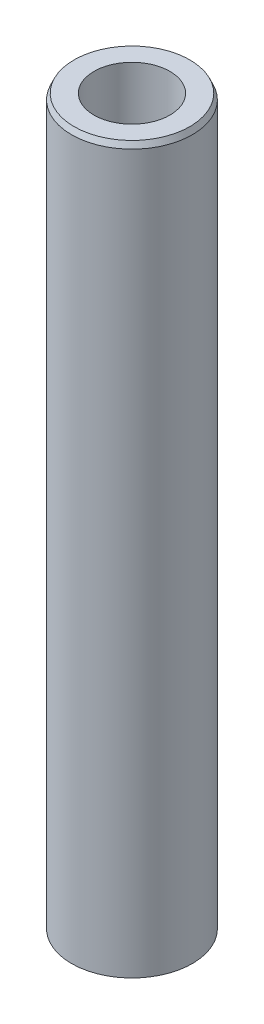
ISO-10303-21;
HEADER;
FILE_DESCRIPTION(('STEP AP214'),'2;1');
FILE_NAME('part.step','',(''),(''),'','','');
FILE_SCHEMA(('AUTOMOTIVE_DESIGN { 1 0 10303 214 1 1 1 1 }'));
ENDSEC;
DATA;
#1=APPLICATION_CONTEXT('core data for automotive mechanical design processes');
#2=APPLICATION_PROTOCOL_DEFINITION('international standard','automotive_design',2000,#1);
#3=PRODUCT_CONTEXT('',#1,'mechanical');
#4=PRODUCT('Part','Part','',(#3));
#5=PRODUCT_RELATED_PRODUCT_CATEGORY('part','',(#4));
#6=PRODUCT_DEFINITION_FORMATION('','',#4);
#7=PRODUCT_DEFINITION_CONTEXT('part definition',#1,'design');
#8=PRODUCT_DEFINITION('design','',#6,#7);
#9=PRODUCT_DEFINITION_SHAPE('','',#8);
#10=(LENGTH_UNIT() NAMED_UNIT(*) SI_UNIT(.MILLI.,.METRE.));
#11=(NAMED_UNIT(*) PLANE_ANGLE_UNIT() SI_UNIT($,.RADIAN.));
#12=(NAMED_UNIT(*) SI_UNIT($,.STERADIAN.) SOLID_ANGLE_UNIT());
#13=UNCERTAINTY_MEASURE_WITH_UNIT(LENGTH_MEASURE(1.E-05),#10,'distance_accuracy_value','');
#14=(GEOMETRIC_REPRESENTATION_CONTEXT(3) GLOBAL_UNCERTAINTY_ASSIGNED_CONTEXT((#13)) GLOBAL_UNIT_ASSIGNED_CONTEXT((#10,
#11,#12)) REPRESENTATION_CONTEXT('',''));
#15=CARTESIAN_POINT('',(0.,0.,0.));
#16=DIRECTION('',(0.,0.,1.));
#17=DIRECTION('',(1.,0.,0.));
#18=AXIS2_PLACEMENT_3D('',#15,#16,#17);
#19=CARTESIAN_POINT('',(0.,330.461544823113,0.));
#20=DIRECTION('',(0.,-1.,0.));
#21=DIRECTION('',(0.,0.,-1.));
#22=AXIS2_PLACEMENT_3D('',#19,#20,#21);
#23=CYLINDRICAL_SURFACE('',#22,27.5);
#24=CARTESIAN_POINT('',(0.,327.852039255736,0.));
#25=DIRECTION('',(0.,1.,0.));
#26=DIRECTION('',(0.,0.,1.));
#27=AXIS2_PLACEMENT_3D('',#24,#25,#26);
#28=CIRCLE('',#27,27.5);
#29=CARTESIAN_POINT('',(0.,327.852039255736,27.5));
#30=VERTEX_POINT('',#29);
#31=EDGE_CURVE('E50',#30,#30,#28,.F.);
#32=ORIENTED_EDGE('',*,*,#31,.T.);
#33=EDGE_LOOP('',(#32));
#34=FACE_BOUND('',#33,.T.);
#35=CARTESIAN_POINT('',(0.,1.16845760781692,0.));
#36=DIRECTION('',(0.,1.,0.));
#37=DIRECTION('',(0.,0.,1.));
#38=AXIS2_PLACEMENT_3D('',#35,#36,#37);
#39=CIRCLE('',#38,27.5);
#40=CARTESIAN_POINT('',(0.,1.16845760781692,27.5));
#41=VERTEX_POINT('',#40);
#42=EDGE_CURVE('E51',#41,#41,#39,.T.);
#43=ORIENTED_EDGE('',*,*,#42,.T.);
#44=EDGE_LOOP('',(#43));
#45=FACE_BOUND('',#44,.T.);
#46=ADVANCED_FACE('F39',(#34,#45),#23,.T.);
#47=CARTESIAN_POINT('',(0.,330.461544823113,0.));
#48=DIRECTION('',(0.,1.,0.));
#49=DIRECTION('',(0.,0.,1.));
#50=AXIS2_PLACEMENT_3D('',#47,#48,#49);
#51=PLANE('',#50);
#52=CARTESIAN_POINT('',(0.,330.461544823113,0.));
#53=DIRECTION('',(0.,1.,0.));
#54=DIRECTION('',(0.,0.,1.));
#55=AXIS2_PLACEMENT_3D('',#52,#53,#54);
#56=CIRCLE('',#55,26.331542392183);
#57=CARTESIAN_POINT('',(0.,330.461544823113,26.331542392183));
#58=VERTEX_POINT('',#57);
#59=EDGE_CURVE('E54',#58,#58,#56,.T.);
#60=ORIENTED_EDGE('',*,*,#59,.T.);
#61=EDGE_LOOP('',(#60));
#62=FACE_BOUND('',#61,.T.);
#63=CARTESIAN_POINT('',(0.,330.461544823113,0.));
#64=DIRECTION('',(0.,1.,0.));
#65=DIRECTION('',(0.,0.,1.));
#66=AXIS2_PLACEMENT_3D('',#63,#64,#65);
#67=CIRCLE('',#66,17.2671316497268);
#68=CARTESIAN_POINT('',(0.,330.461544823113,17.2671316497268));
#69=VERTEX_POINT('',#68);
#70=EDGE_CURVE('E58',#69,#69,#67,.T.);
#71=ORIENTED_EDGE('',*,*,#70,.F.);
#72=EDGE_LOOP('',(#71));
#73=FACE_BOUND('',#72,.T.);
#74=ADVANCED_FACE('F69',(#62,#73),#51,.T.);
#75=CARTESIAN_POINT('',(0.,0.,0.));
#76=DIRECTION('',(0.,1.,0.));
#77=DIRECTION('',(0.,0.,1.));
#78=AXIS2_PLACEMENT_3D('',#75,#76,#77);
#79=PLANE('',#78);
#80=CARTESIAN_POINT('',(0.,0.,0.));
#81=DIRECTION('',(0.,1.,0.));
#82=DIRECTION('',(0.,0.,1.));
#83=AXIS2_PLACEMENT_3D('',#80,#81,#82);
#84=CIRCLE('',#83,24.8904944326226);
#85=CARTESIAN_POINT('',(0.,0.,24.8904944326226));
#86=VERTEX_POINT('',#85);
#87=EDGE_CURVE('E10',#86,#86,#84,.F.);
#88=ORIENTED_EDGE('',*,*,#87,.T.);
#89=EDGE_LOOP('',(#88));
#90=FACE_BOUND('',#89,.T.);
#91=CARTESIAN_POINT('',(0.,0.,0.));
#92=DIRECTION('',(0.,1.,0.));
#93=DIRECTION('',(0.,0.,1.));
#94=AXIS2_PLACEMENT_3D('',#91,#92,#93);
#95=CIRCLE('',#94,17.2671316497268);
#96=CARTESIAN_POINT('',(0.,0.,17.2671316497268));
#97=VERTEX_POINT('',#96);
#98=EDGE_CURVE('E63',#97,#97,#95,.T.);
#99=ORIENTED_EDGE('',*,*,#98,.T.);
#100=EDGE_LOOP('',(#99));
#101=FACE_BOUND('',#100,.T.);
#102=ADVANCED_FACE('F75',(#90,#101),#79,.F.);
#103=CARTESIAN_POINT('',(0.,330.461544823113,0.));
#104=DIRECTION('',(0.,-1.,0.));
#105=DIRECTION('',(0.,0.,-1.));
#106=AXIS2_PLACEMENT_3D('',#103,#104,#105);
#107=CYLINDRICAL_SURFACE('',#106,17.2671316497268);
#108=ORIENTED_EDGE('',*,*,#70,.T.);
#109=EDGE_LOOP('',(#108));
#110=FACE_BOUND('',#109,.T.);
#111=ORIENTED_EDGE('',*,*,#98,.F.);
#112=EDGE_LOOP('',(#111));
#113=FACE_BOUND('',#112,.T.);
#114=ADVANCED_FACE('F70',(#110,#113),#107,.F.);
#115=CARTESIAN_POINT('',(0.,330.461544823113,0.));
#116=DIRECTION('',(0.,-1.,0.));
#117=DIRECTION('',(0.,0.,-1.));
#118=AXIS2_PLACEMENT_3D('',#115,#116,#117);
#119=CONICAL_SURFACE('',#118,26.331542392183,0.420997686063849);
#120=ORIENTED_EDGE('',*,*,#31,.F.);
#121=EDGE_LOOP('',(#120));
#122=FACE_BOUND('',#121,.T.);
#123=ORIENTED_EDGE('',*,*,#59,.F.);
#124=EDGE_LOOP('',(#123));
#125=FACE_BOUND('',#124,.T.);
#126=ADVANCED_FACE('F81',(#122,#125),#119,.T.);
#127=CARTESIAN_POINT('',(0.,1.16845760781692,0.));
#128=DIRECTION('',(0.,1.,0.));
#129=DIRECTION('',(0.,0.,1.));
#130=AXIS2_PLACEMENT_3D('',#127,#128,#129);
#131=CONICAL_SURFACE('',#130,27.5,1.14979864073106);
#132=CARTESIAN_POINT('',(0.,0.,24.8904944326226));
#133=CARTESIAN_POINT('',(0.,0.0121714334147591,24.9176767822828));
#134=CARTESIAN_POINT('',(0.,0.0243428668295188,24.944859131943));
#135=CARTESIAN_POINT('',(0.,0.0486857336590382,24.9992238312633));
#136=CARTESIAN_POINT('',(0.,0.060857167073798,25.0264061809235));
#137=CARTESIAN_POINT('',(0.,0.085200033903317,25.0807708802439));
#138=CARTESIAN_POINT('',(0.,0.0973714673180763,25.107953229904));
#139=CARTESIAN_POINT('',(0.,0.121714334147595,25.1623179292244));
#140=CARTESIAN_POINT('',(0.,0.133885767562355,25.1895002788846));
#141=CARTESIAN_POINT('',(0.,0.158228634391874,25.2438649782049));
#142=CARTESIAN_POINT('',(0.,0.170400067806634,25.2710473278651));
#143=CARTESIAN_POINT('',(0.,0.194742934636153,25.3254120271855));
#144=CARTESIAN_POINT('',(0.,0.206914368050912,25.3525943768457));
#145=CARTESIAN_POINT('',(0.,0.231257234880431,25.406959076166));
#146=CARTESIAN_POINT('',(0.,0.243428668295191,25.4341414258262));
#147=CARTESIAN_POINT('',(0.,0.267771535124711,25.4885061251466));
#148=CARTESIAN_POINT('',(0.,0.27994296853947,25.5156884748068));
#149=CARTESIAN_POINT('',(0.,0.304285835368989,25.5700531741271));
#150=CARTESIAN_POINT('',(0.,0.316457268783749,25.5972355237873));
#151=CARTESIAN_POINT('',(0.,0.340800135613268,25.6516002231077));
#152=CARTESIAN_POINT('',(0.,0.352971569028027,25.6787825727679));
#153=CARTESIAN_POINT('',(0.,0.377314435857547,25.7331472720882));
#154=CARTESIAN_POINT('',(0.,0.389485869272307,25.7603296217484));
#155=CARTESIAN_POINT('',(0.,0.413828736101826,25.8146943210688));
#156=CARTESIAN_POINT('',(0.,0.426000169516585,25.8418766707289));
#157=CARTESIAN_POINT('',(0.,0.450343036346104,25.8962413700493));
#158=CARTESIAN_POINT('',(0.,0.462514469760864,25.9234237197095));
#159=CARTESIAN_POINT('',(0.,0.486857336590383,25.9777884190298));
#160=CARTESIAN_POINT('',(0.,0.499028770005143,26.00497076869));
#161=CARTESIAN_POINT('',(0.,0.523371636834662,26.0593354680104));
#162=CARTESIAN_POINT('',(0.,0.535543070249421,26.0865178176706));
#163=CARTESIAN_POINT('',(0.,0.55988593707894,26.1408825169909));
#164=CARTESIAN_POINT('',(0.,0.5720573704937,26.1680648666511));
#165=CARTESIAN_POINT('',(0.,0.596400237323219,26.2224295659715));
#166=CARTESIAN_POINT('',(0.,0.608571670737979,26.2496119156317));
#167=CARTESIAN_POINT('',(0.,0.632914537567498,26.303976614952));
#168=CARTESIAN_POINT('',(0.,0.645085970982257,26.3311589646122));
#169=CARTESIAN_POINT('',(0.,0.669428837811776,26.3855236639326));
#170=CARTESIAN_POINT('',(0.,0.681600271226536,26.4127060135928));
#171=CARTESIAN_POINT('',(0.,0.705943138056055,26.4670707129131));
#172=CARTESIAN_POINT('',(0.,0.718114571470815,26.4942530625733));
#173=CARTESIAN_POINT('',(0.,0.742457438300334,26.5486177618937));
#174=CARTESIAN_POINT('',(0.,0.754628871715094,26.5758001115538));
#175=CARTESIAN_POINT('',(0.,0.778971738544613,26.6301648108742));
#176=CARTESIAN_POINT('',(0.,0.791143171959373,26.6573471605344));
#177=CARTESIAN_POINT('',(0.,0.815486038788891,26.7117118598547));
#178=CARTESIAN_POINT('',(0.,0.827657472203651,26.7388942095149));
#179=CARTESIAN_POINT('',(0.,0.852000339033171,26.7932589088353));
#180=CARTESIAN_POINT('',(0.,0.86417177244793,26.8204412584955));
#181=CARTESIAN_POINT('',(0.,0.888514639277449,26.8748059578158));
#182=CARTESIAN_POINT('',(0.,0.900686072692209,26.901988307476));
#183=CARTESIAN_POINT('',(0.,0.925028939521728,26.9563530067964));
#184=CARTESIAN_POINT('',(0.,0.937200372936487,26.9835353564566));
#185=CARTESIAN_POINT('',(0.,0.961543239766007,27.0379000557769));
#186=CARTESIAN_POINT('',(0.,0.973714673180767,27.0650824054371));
#187=CARTESIAN_POINT('',(0.,0.998057540010285,27.1194471047575));
#188=CARTESIAN_POINT('',(0.,1.01022897342504,27.1466294544176));
#189=CARTESIAN_POINT('',(0.,1.03457184025456,27.200994153738));
#190=CARTESIAN_POINT('',(0.,1.04674327366932,27.2281765033982));
#191=CARTESIAN_POINT('',(0.,1.07108614049884,27.2825412027186));
#192=CARTESIAN_POINT('',(0.,1.0832575739136,27.3097235523787));
#193=CARTESIAN_POINT('',(0.,1.10760044074312,27.3640882516991));
#194=CARTESIAN_POINT('',(0.,1.11977187415788,27.3912706013593));
#195=CARTESIAN_POINT('',(0.,1.1441147409874,27.4456353006796));
#196=CARTESIAN_POINT('',(0.,1.15628617440216,27.4728176503398));
#197=CARTESIAN_POINT('',(0.,1.16845760781692,27.5));
#198=B_SPLINE_CURVE_WITH_KNOTS('',3,(#132,#133,#134,#135,#136,#137,#138,#139,#140,#141,#142,
#143,#144,#145,#146,#147,#148,#149,#150,#151,#152,#153,#154,#155,#156,#157,#158,#159,#160,#161,
#162,#163,#164,#165,#166,#167,#168,#169,#170,#171,#172,#173,#174,#175,#176,#177,#178,#179,#180,
#181,#182,#183,#184,#185,#186,#187,#188,#189,#190,#191,#192,#193,#194,#195,#196,#197),
.UNSPECIFIED.,.F.,.F.,(4,2,2,2,2,2,2,2,2,2,2,2,2,2,2,2,2,2,2,2,2,2,2,2,2,2,2,2,2,2,2,2,4),(0.,
0.0893488406179086,0.178697681235817,0.268046521853729,0.357395362471637,0.446744203089546,
0.536093043707458,0.625441884325366,0.714790724943275,0.804139565561187,0.893488406179095,
0.982837246797004,1.07218608741492,1.16153492803282,1.25088376865073,1.34023260926864,
1.42958144988655,1.51893029050446,1.60827913112237,1.69762797174028,1.78697681235819,
1.8763256529761,1.96567449359401,2.05502333421192,2.14437217482983,2.23372101544774,
2.32306985606565,2.41241869668356,2.50176753730147,2.59111637791938,2.68046521853729,
2.7698140591552,2.85916289977311),.UNSPECIFIED.);
#199=EDGE_CURVE('BSEAM45',#86,#41,#198,.T.);
#200=ORIENTED_EDGE('',*,*,#87,.F.);
#201=ORIENTED_EDGE('',*,*,#42,.F.);
#202=ORIENTED_EDGE('',*,*,#199,.T.);
#203=ORIENTED_EDGE('',*,*,#199,.F.);
#204=EDGE_LOOP('',(#200,#202,#201,#203));
#205=FACE_BOUND('',#204,.T.);
#206=ADVANCED_FACE('F45',(#205),#131,.T.);
#207=CLOSED_SHELL('',(#46,#74,#102,#114,#126,#206));
#208=MANIFOLD_SOLID_BREP('B2',#207);
#209=ADVANCED_BREP_SHAPE_REPRESENTATION('',(#18,#208),#14);
#210=SHAPE_DEFINITION_REPRESENTATION(#9,#209);
ENDSEC;
END-ISO-10303-21;
